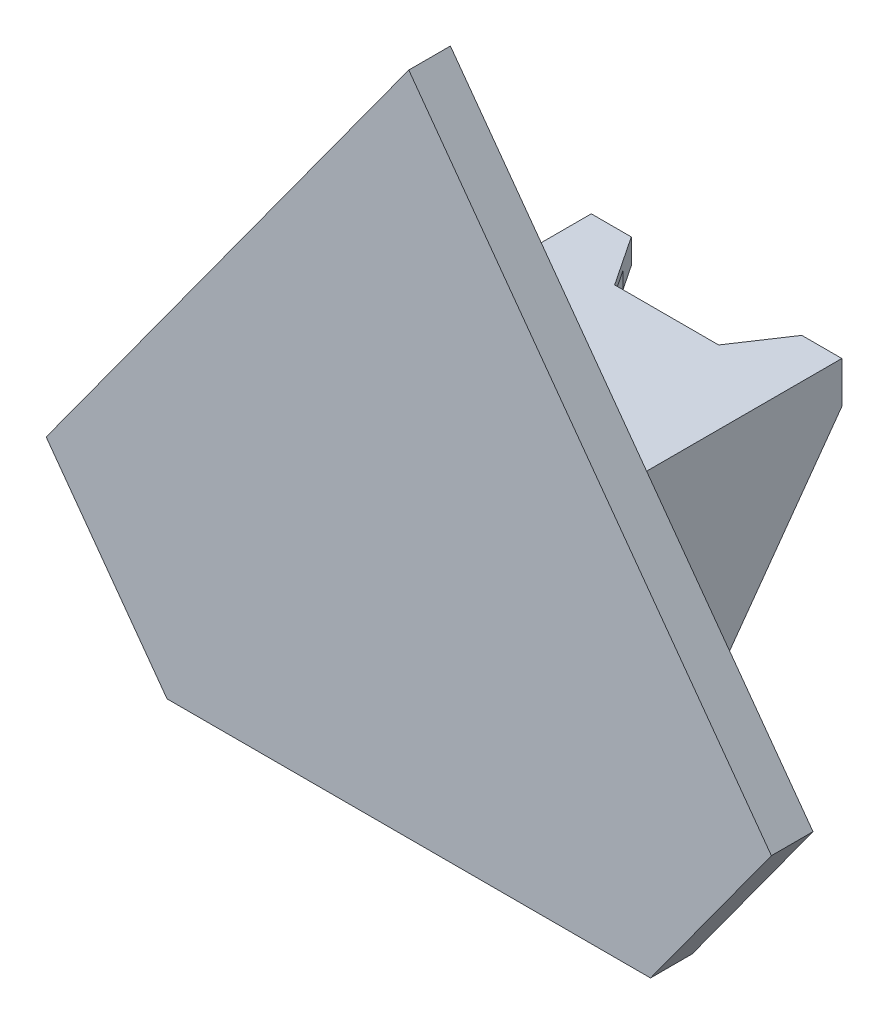
ISO-10303-21;
HEADER;
FILE_DESCRIPTION(('STEP AP214'),'2;1');
FILE_NAME('part.step','',(''),(''),'','','');
FILE_SCHEMA(('AUTOMOTIVE_DESIGN { 1 0 10303 214 1 1 1 1 }'));
ENDSEC;
DATA;
#1=APPLICATION_CONTEXT('core data for automotive mechanical design processes');
#2=APPLICATION_PROTOCOL_DEFINITION('international standard','automotive_design',2000,#1);
#3=PRODUCT_CONTEXT('',#1,'mechanical');
#4=PRODUCT('Part','Part','',(#3));
#5=PRODUCT_RELATED_PRODUCT_CATEGORY('part','',(#4));
#6=PRODUCT_DEFINITION_FORMATION('','',#4);
#7=PRODUCT_DEFINITION_CONTEXT('part definition',#1,'design');
#8=PRODUCT_DEFINITION('design','',#6,#7);
#9=PRODUCT_DEFINITION_SHAPE('','',#8);
#10=(LENGTH_UNIT() NAMED_UNIT(*) SI_UNIT(.MILLI.,.METRE.));
#11=(NAMED_UNIT(*) PLANE_ANGLE_UNIT() SI_UNIT($,.RADIAN.));
#12=(NAMED_UNIT(*) SI_UNIT($,.STERADIAN.) SOLID_ANGLE_UNIT());
#13=UNCERTAINTY_MEASURE_WITH_UNIT(LENGTH_MEASURE(1.E-05),#10,'distance_accuracy_value','');
#14=(GEOMETRIC_REPRESENTATION_CONTEXT(3) GLOBAL_UNCERTAINTY_ASSIGNED_CONTEXT((#13)) GLOBAL_UNIT_ASSIGNED_CONTEXT((#10,
#11,#12)) REPRESENTATION_CONTEXT('',''));
#15=CARTESIAN_POINT('',(0.,0.,0.));
#16=DIRECTION('',(0.,0.,1.));
#17=DIRECTION('',(1.,0.,0.));
#18=AXIS2_PLACEMENT_3D('',#15,#16,#17);
#19=CARTESIAN_POINT('',(0.,32.5,0.));
#20=DIRECTION('',(0.,-1.,0.));
#21=DIRECTION('',(0.,0.,-1.));
#22=AXIS2_PLACEMENT_3D('',#19,#20,#21);
#23=PLANE('',#22);
#24=CARTESIAN_POINT('',(-10.2499,32.5,-8.7));
#25=DIRECTION('',(0.,1.,0.));
#26=DIRECTION('',(0.,0.,1.));
#27=AXIS2_PLACEMENT_3D('',#24,#25,#26);
#28=CIRCLE('',#27,1.05);
#29=CARTESIAN_POINT('',(-10.2499,32.5,-7.65));
#30=VERTEX_POINT('',#29);
#31=EDGE_CURVE('E354',#30,#30,#28,.T.);
#32=ORIENTED_EDGE('',*,*,#31,.T.);
#33=EDGE_LOOP('',(#32));
#34=FACE_BOUND('',#33,.T.);
#35=DIRECTION('',(-0.554690595534133,0.,-0.832056694718568));
#36=VECTOR('',#35,1.);
#37=CARTESIAN_POINT('',(-10.2499,32.5,-32.));
#38=LINE('',#37,#36);
#39=CARTESIAN_POINT('',(-8.24994999999999,32.5,-29.));
#40=VERTEX_POINT('',#39);
#41=CARTESIAN_POINT('',(-10.2499,32.5,-32.));
#42=VERTEX_POINT('',#41);
#43=EDGE_CURVE('E235',#40,#42,#38,.T.);
#44=ORIENTED_EDGE('',*,*,#43,.F.);
#45=DIRECTION('',(0.,0.,1.));
#46=VECTOR('',#45,1.);
#47=CARTESIAN_POINT('',(-8.24994999999999,32.5,-36.));
#48=LINE('',#47,#46);
#49=CARTESIAN_POINT('',(-8.24994999999999,32.5,-2.5));
#50=VERTEX_POINT('',#49);
#51=EDGE_CURVE('E216',#40,#50,#48,.T.);
#52=ORIENTED_EDGE('',*,*,#51,.T.);
#53=DIRECTION('',(-1.,0.,0.));
#54=VECTOR('',#53,1.);
#55=CARTESIAN_POINT('',(-12.561,32.5,-2.5));
#56=LINE('',#55,#54);
#57=CARTESIAN_POINT('',(-12.561,32.5,-2.5));
#58=VERTEX_POINT('',#57);
#59=EDGE_CURVE('E226',#50,#58,#56,.T.);
#60=ORIENTED_EDGE('',*,*,#59,.T.);
#61=DIRECTION('',(0.,0.,-1.));
#62=VECTOR('',#61,1.);
#63=CARTESIAN_POINT('',(-12.561,32.5,-2.5));
#64=LINE('',#63,#62);
#65=CARTESIAN_POINT('',(-12.561,32.5,-32.));
#66=VERTEX_POINT('',#65);
#67=EDGE_CURVE('E241',#58,#66,#64,.T.);
#68=ORIENTED_EDGE('',*,*,#67,.T.);
#69=DIRECTION('',(-1.,0.,0.));
#70=VECTOR('',#69,1.);
#71=CARTESIAN_POINT('',(-15.061,32.5,-32.));
#72=LINE('',#71,#70);
#73=EDGE_CURVE('E369',#42,#66,#72,.T.);
#74=ORIENTED_EDGE('',*,*,#73,.F.);
#75=EDGE_LOOP('',(#44,#52,#60,#68,#74));
#76=FACE_BOUND('',#75,.T.);
#77=ADVANCED_FACE('F39',(#34,#76),#23,.T.);
#78=CARTESIAN_POINT('',(6.25,35.5,-26.));
#79=DIRECTION('',(0.832056694718569,0.,0.554690595534133));
#80=DIRECTION('',(0.554690595534133,0.,-0.832056694718568));
#81=AXIS2_PLACEMENT_3D('',#78,#79,#80);
#82=PLANE('',#81);
#83=DIRECTION('',(0.,-1.,0.));
#84=VECTOR('',#83,1.);
#85=CARTESIAN_POINT('',(8.24994999999999,35.5,-29.));
#86=LINE('',#85,#84);
#87=CARTESIAN_POINT('',(8.24994999999999,34.5,-29.));
#88=VERTEX_POINT('',#87);
#89=CARTESIAN_POINT('',(8.24994999999999,32.5,-29.));
#90=VERTEX_POINT('',#89);
#91=EDGE_CURVE('E11',#88,#90,#86,.T.);
#92=ORIENTED_EDGE('',*,*,#91,.F.);
#93=DIRECTION('',(0.554690595534133,0.,-0.832056694718568));
#94=VECTOR('',#93,1.);
#95=CARTESIAN_POINT('',(6.25,34.5,-26.));
#96=LINE('',#95,#94);
#97=CARTESIAN_POINT('',(6.25,34.5,-26.));
#98=VERTEX_POINT('',#97);
#99=EDGE_CURVE('E291',#98,#88,#96,.T.);
#100=ORIENTED_EDGE('',*,*,#99,.F.);
#101=DIRECTION('',(0.,-1.,0.));
#102=VECTOR('',#101,1.);
#103=CARTESIAN_POINT('',(6.25,35.5,-26.));
#104=LINE('',#103,#102);
#105=CARTESIAN_POINT('',(6.25,35.5,-26.));
#106=VERTEX_POINT('',#105);
#107=EDGE_CURVE('E294',#106,#98,#104,.T.);
#108=ORIENTED_EDGE('',*,*,#107,.F.);
#109=DIRECTION('',(-0.554690595534133,0.,0.832056694718568));
#110=VECTOR('',#109,1.);
#111=CARTESIAN_POINT('',(6.25,35.5,-26.));
#112=LINE('',#111,#110);
#113=CARTESIAN_POINT('',(10.2499,35.5,-32.));
#114=VERTEX_POINT('',#113);
#115=EDGE_CURVE('E374',#114,#106,#112,.T.);
#116=ORIENTED_EDGE('',*,*,#115,.F.);
#117=DIRECTION('',(0.,-1.,0.));
#118=VECTOR('',#117,1.);
#119=CARTESIAN_POINT('',(10.2499,35.5,-32.));
#120=LINE('',#119,#118);
#121=CARTESIAN_POINT('',(10.2499,32.5,-32.));
#122=VERTEX_POINT('',#121);
#123=EDGE_CURVE('E398',#114,#122,#120,.T.);
#124=ORIENTED_EDGE('',*,*,#123,.T.);
#125=DIRECTION('',(-0.554690595534133,0.,0.832056694718568));
#126=VECTOR('',#125,1.);
#127=CARTESIAN_POINT('',(6.25,32.5,-26.));
#128=LINE('',#127,#126);
#129=EDGE_CURVE('E389',#122,#90,#128,.T.);
#130=ORIENTED_EDGE('',*,*,#129,.T.);
#131=EDGE_LOOP('',(#92,#100,#108,#116,#124,#130));
#132=FACE_BOUND('',#131,.T.);
#133=ADVANCED_FACE('F472',(#132),#82,.F.);
#134=CARTESIAN_POINT('',(-6.25,35.5,-26.));
#135=DIRECTION('',(0.,0.,1.));
#136=DIRECTION('',(1.,0.,0.));
#137=AXIS2_PLACEMENT_3D('',#134,#135,#136);
#138=PLANE('',#137);
#139=DIRECTION('',(1.,0.,0.));
#140=VECTOR('',#139,1.);
#141=CARTESIAN_POINT('',(-6.25,34.5,-26.));
#142=LINE('',#141,#140);
#143=CARTESIAN_POINT('',(-6.25,34.5,-26.));
#144=VERTEX_POINT('',#143);
#145=EDGE_CURVE('E289',#144,#98,#142,.T.);
#146=ORIENTED_EDGE('',*,*,#145,.F.);
#147=DIRECTION('',(0.,-1.,0.));
#148=VECTOR('',#147,1.);
#149=CARTESIAN_POINT('',(-6.25,35.5,-26.));
#150=LINE('',#149,#148);
#151=CARTESIAN_POINT('',(-6.25,35.5,-26.));
#152=VERTEX_POINT('',#151);
#153=EDGE_CURVE('E284',#152,#144,#150,.T.);
#154=ORIENTED_EDGE('',*,*,#153,.F.);
#155=DIRECTION('',(-1.,0.,0.));
#156=VECTOR('',#155,1.);
#157=CARTESIAN_POINT('',(-6.25,35.5,-26.));
#158=LINE('',#157,#156);
#159=EDGE_CURVE('E380',#106,#152,#158,.T.);
#160=ORIENTED_EDGE('',*,*,#159,.F.);
#161=ORIENTED_EDGE('',*,*,#107,.T.);
#162=EDGE_LOOP('',(#146,#154,#160,#161));
#163=FACE_BOUND('',#162,.T.);
#164=ADVANCED_FACE('F287',(#163),#138,.F.);
#165=CARTESIAN_POINT('',(-10.2499,35.5,-32.));
#166=DIRECTION('',(-0.832056694718569,0.,0.554690595534133));
#167=DIRECTION('',(0.554690595534133,0.,0.832056694718568));
#168=AXIS2_PLACEMENT_3D('',#165,#166,#167);
#169=PLANE('',#168);
#170=DIRECTION('',(0.,1.,0.));
#171=VECTOR('',#170,1.);
#172=CARTESIAN_POINT('',(-8.24994999999999,35.5,-29.));
#173=LINE('',#172,#171);
#174=CARTESIAN_POINT('',(-8.24994999999999,34.5,-29.));
#175=VERTEX_POINT('',#174);
#176=EDGE_CURVE('E50',#40,#175,#173,.T.);
#177=ORIENTED_EDGE('',*,*,#176,.F.);
#178=ORIENTED_EDGE('',*,*,#43,.T.);
#179=DIRECTION('',(0.,-1.,0.));
#180=VECTOR('',#179,1.);
#181=CARTESIAN_POINT('',(-10.2499,35.5,-32.));
#182=LINE('',#181,#180);
#183=CARTESIAN_POINT('',(-10.2499,35.5,-32.));
#184=VERTEX_POINT('',#183);
#185=EDGE_CURVE('E384',#184,#42,#182,.T.);
#186=ORIENTED_EDGE('',*,*,#185,.F.);
#187=DIRECTION('',(-0.554690595534133,0.,-0.832056694718568));
#188=VECTOR('',#187,1.);
#189=CARTESIAN_POINT('',(-10.2499,35.5,-32.));
#190=LINE('',#189,#188);
#191=EDGE_CURVE('E376',#152,#184,#190,.T.);
#192=ORIENTED_EDGE('',*,*,#191,.F.);
#193=ORIENTED_EDGE('',*,*,#153,.T.);
#194=DIRECTION('',(0.554690595534133,0.,0.832056694718568));
#195=VECTOR('',#194,1.);
#196=CARTESIAN_POINT('',(-10.2499,34.5,-32.));
#197=LINE('',#196,#195);
#198=EDGE_CURVE('E276',#175,#144,#197,.T.);
#199=ORIENTED_EDGE('',*,*,#198,.F.);
#200=EDGE_LOOP('',(#177,#178,#186,#192,#193,#199));
#201=FACE_BOUND('',#200,.T.);
#202=ADVANCED_FACE('F279',(#201),#169,.F.);
#203=CARTESIAN_POINT('',(-43.5925516803215,16.5,5.));
#204=DIRECTION('',(0.809016994374949,-0.587785252292471,0.));
#205=DIRECTION('',(0.587785252292471,0.809016994374949,0.));
#206=AXIS2_PLACEMENT_3D('',#203,#204,#205);
#207=PLANE('',#206);
#208=DIRECTION('',(0.,0.,-1.));
#209=VECTOR('',#208,1.);
#210=CARTESIAN_POINT('',(-43.5925516803215,16.5,5.));
#211=LINE('',#210,#209);
#212=CARTESIAN_POINT('',(-43.5925516803215,16.5,5.));
#213=VERTEX_POINT('',#212);
#214=CARTESIAN_POINT('',(-43.5925516803215,16.5,0.));
#215=VERTEX_POINT('',#214);
#216=EDGE_CURVE('E314',#213,#215,#211,.T.);
#217=ORIENTED_EDGE('',*,*,#216,.F.);
#218=DIRECTION('',(-0.587785252292471,-0.809016994374949,0.));
#219=VECTOR('',#218,1.);
#220=CARTESIAN_POINT('',(-43.5925516803215,16.5,5.));
#221=LINE('',#220,#219);
#222=CARTESIAN_POINT('',(0.,76.5,5.));
#223=VERTEX_POINT('',#222);
#224=EDGE_CURVE('E322',#223,#213,#221,.T.);
#225=ORIENTED_EDGE('',*,*,#224,.F.);
#226=DIRECTION('',(0.,0.,-1.));
#227=VECTOR('',#226,1.);
#228=CARTESIAN_POINT('',(0.,76.5,5.));
#229=LINE('',#228,#227);
#230=CARTESIAN_POINT('',(0.,76.5,0.));
#231=VERTEX_POINT('',#230);
#232=EDGE_CURVE('E328',#223,#231,#229,.T.);
#233=ORIENTED_EDGE('',*,*,#232,.T.);
#234=DIRECTION('',(-0.587785252292471,-0.809016994374949,0.));
#235=VECTOR('',#234,1.);
#236=CARTESIAN_POINT('',(-43.5925516803215,16.5,0.));
#237=LINE('',#236,#235);
#238=EDGE_CURVE('E323',#231,#215,#237,.T.);
#239=ORIENTED_EDGE('',*,*,#238,.T.);
#240=EDGE_LOOP('',(#217,#225,#233,#239));
#241=FACE_BOUND('',#240,.T.);
#242=ADVANCED_FACE('F714',(#241),#207,.F.);
#243=CARTESIAN_POINT('',(-58.1234022404286,-3.50000000000001,122.954735182657));
#244=DIRECTION('',(0.,1.,0.));
#245=DIRECTION('',(0.,0.,1.));
#246=AXIS2_PLACEMENT_3D('',#243,#244,#245);
#247=PLANE('',#246);
#248=DIRECTION('',(0.,0.,-1.));
#249=VECTOR('',#248,1.);
#250=CARTESIAN_POINT('',(29.0617011202143,-3.50000000000001,5.));
#251=LINE('',#250,#249);
#252=CARTESIAN_POINT('',(29.0617011202143,-3.50000000000001,5.));
#253=VERTEX_POINT('',#252);
#254=CARTESIAN_POINT('',(29.0617011202143,-3.50000000000001,0.));
#255=VERTEX_POINT('',#254);
#256=EDGE_CURVE('E304',#253,#255,#251,.T.);
#257=ORIENTED_EDGE('',*,*,#256,.F.);
#258=DIRECTION('',(-1.,0.,0.));
#259=VECTOR('',#258,1.);
#260=CARTESIAN_POINT('',(-58.1234022404286,-3.50000000000001,5.));
#261=LINE('',#260,#259);
#262=CARTESIAN_POINT('',(-29.0617011202143,-3.5,5.));
#263=VERTEX_POINT('',#262);
#264=EDGE_CURVE('E319',#253,#263,#261,.T.);
#265=ORIENTED_EDGE('',*,*,#264,.T.);
#266=DIRECTION('',(0.,0.,-1.));
#267=VECTOR('',#266,1.);
#268=CARTESIAN_POINT('',(-29.0617011202143,-3.5,5.));
#269=LINE('',#268,#267);
#270=CARTESIAN_POINT('',(-29.0617011202143,-3.50000000000001,0.));
#271=VERTEX_POINT('',#270);
#272=EDGE_CURVE('E298',#263,#271,#269,.T.);
#273=ORIENTED_EDGE('',*,*,#272,.T.);
#274=DIRECTION('',(1.,0.,0.));
#275=VECTOR('',#274,1.);
#276=CARTESIAN_POINT('',(-58.1234022404286,-3.50000000000001,0.));
#277=LINE('',#276,#275);
#278=EDGE_CURVE('E309',#271,#255,#277,.T.);
#279=ORIENTED_EDGE('',*,*,#278,.T.);
#280=EDGE_LOOP('',(#257,#265,#273,#279));
#281=FACE_BOUND('',#280,.T.);
#282=ADVANCED_FACE('F710',(#281),#247,.F.);
#283=CARTESIAN_POINT('',(-15.061,32.5,-32.));
#284=DIRECTION('',(1.,0.,0.));
#285=DIRECTION('',(0.,0.,-1.));
#286=AXIS2_PLACEMENT_3D('',#283,#284,#285);
#287=PLANE('',#286);
#288=DIRECTION('',(0.,0.811029676142761,-0.585005012299697));
#289=VECTOR('',#288,1.);
#290=CARTESIAN_POINT('',(-15.061,0.,-10.));
#291=LINE('',#290,#289);
#292=CARTESIAN_POINT('',(-15.061,0.,-10.));
#293=VERTEX_POINT('',#292);
#294=CARTESIAN_POINT('',(-15.061,30.5,-32.));
#295=VERTEX_POINT('',#294);
#296=EDGE_CURVE('E338',#293,#295,#291,.T.);
#297=ORIENTED_EDGE('',*,*,#296,.F.);
#298=DIRECTION('',(0.,1.,0.));
#299=VECTOR('',#298,1.);
#300=CARTESIAN_POINT('',(-15.061,-2.5,-10.));
#301=LINE('',#300,#299);
#302=CARTESIAN_POINT('',(-15.061,-2.5,-10.));
#303=VERTEX_POINT('',#302);
#304=EDGE_CURVE('E255',#303,#293,#301,.T.);
#305=ORIENTED_EDGE('',*,*,#304,.F.);
#306=DIRECTION('',(0.,0.,-1.));
#307=VECTOR('',#306,1.);
#308=CARTESIAN_POINT('',(-15.061,-2.5,-10.));
#309=LINE('',#308,#307);
#310=CARTESIAN_POINT('',(-15.061,-2.5,0.));
#311=VERTEX_POINT('',#310);
#312=EDGE_CURVE('E415',#311,#303,#309,.T.);
#313=ORIENTED_EDGE('',*,*,#312,.F.);
#314=DIRECTION('',(0.,-1.,0.));
#315=VECTOR('',#314,1.);
#316=CARTESIAN_POINT('',(-15.061,32.5,0.));
#317=LINE('',#316,#315);
#318=CARTESIAN_POINT('',(-15.061,35.5,0.));
#319=VERTEX_POINT('',#318);
#320=EDGE_CURVE('E268',#319,#311,#317,.T.);
#321=ORIENTED_EDGE('',*,*,#320,.F.);
#322=DIRECTION('',(0.,0.,1.));
#323=VECTOR('',#322,1.);
#324=CARTESIAN_POINT('',(-15.061,35.5,0.));
#325=LINE('',#324,#323);
#326=CARTESIAN_POINT('',(-15.061,35.5,-32.));
#327=VERTEX_POINT('',#326);
#328=EDGE_CURVE('E363',#327,#319,#325,.T.);
#329=ORIENTED_EDGE('',*,*,#328,.F.);
#330=DIRECTION('',(0.,-1.,0.));
#331=VECTOR('',#330,1.);
#332=CARTESIAN_POINT('',(-15.061,32.5,-32.));
#333=LINE('',#332,#331);
#334=EDGE_CURVE('E269',#327,#295,#333,.T.);
#335=ORIENTED_EDGE('',*,*,#334,.T.);
#336=EDGE_LOOP('',(#297,#305,#313,#321,#329,#335));
#337=FACE_BOUND('',#336,.T.);
#338=ADVANCED_FACE('F521',(#337),#287,.F.);
#339=CARTESIAN_POINT('',(-12.561,32.5,-2.5));
#340=DIRECTION('',(-1.,0.,0.));
#341=DIRECTION('',(0.,0.,1.));
#342=AXIS2_PLACEMENT_3D('',#339,#340,#341);
#343=PLANE('',#342);
#344=DIRECTION('',(0.,0.,-1.));
#345=VECTOR('',#344,1.);
#346=CARTESIAN_POINT('',(-12.561,0.,-2.5));
#347=LINE('',#346,#345);
#348=CARTESIAN_POINT('',(-12.561,0.,-2.5));
#349=VERTEX_POINT('',#348);
#350=CARTESIAN_POINT('',(-12.561,0.,-10.));
#351=VERTEX_POINT('',#350);
#352=EDGE_CURVE('E246',#349,#351,#347,.T.);
#353=ORIENTED_EDGE('',*,*,#352,.T.);
#354=DIRECTION('',(0.,0.811029676142761,-0.585005012299697));
#355=VECTOR('',#354,1.);
#356=CARTESIAN_POINT('',(-12.561,17.8190737139827,-22.8531023510695));
#357=LINE('',#356,#355);
#358=CARTESIAN_POINT('',(-12.561,30.5,-32.));
#359=VERTEX_POINT('',#358);
#360=EDGE_CURVE('E348',#351,#359,#357,.T.);
#361=ORIENTED_EDGE('',*,*,#360,.T.);
#362=DIRECTION('',(0.,-1.,0.));
#363=VECTOR('',#362,1.);
#364=CARTESIAN_POINT('',(-12.561,32.5,-32.));
#365=LINE('',#364,#363);
#366=EDGE_CURVE('E273',#66,#359,#365,.T.);
#367=ORIENTED_EDGE('',*,*,#366,.F.);
#368=ORIENTED_EDGE('',*,*,#67,.F.);
#369=DIRECTION('',(0.,-1.,0.));
#370=VECTOR('',#369,1.);
#371=CARTESIAN_POINT('',(-12.561,32.5,-2.5));
#372=LINE('',#371,#370);
#373=EDGE_CURVE('E240',#58,#349,#372,.T.);
#374=ORIENTED_EDGE('',*,*,#373,.T.);
#375=EDGE_LOOP('',(#353,#361,#367,#368,#374));
#376=FACE_BOUND('',#375,.T.);
#377=ADVANCED_FACE('F41',(#376),#343,.F.);
#378=CARTESIAN_POINT('',(-15.061,32.5,-32.));
#379=DIRECTION('',(0.,0.,1.));
#380=DIRECTION('',(1.,0.,0.));
#381=AXIS2_PLACEMENT_3D('',#378,#379,#380);
#382=PLANE('',#381);
#383=ORIENTED_EDGE('',*,*,#366,.T.);
#384=DIRECTION('',(-1.,0.,0.));
#385=VECTOR('',#384,1.);
#386=CARTESIAN_POINT('',(15.061,30.5,-32.));
#387=LINE('',#386,#385);
#388=EDGE_CURVE('E337',#359,#295,#387,.T.);
#389=ORIENTED_EDGE('',*,*,#388,.T.);
#390=ORIENTED_EDGE('',*,*,#334,.F.);
#391=DIRECTION('',(-1.,0.,0.));
#392=VECTOR('',#391,1.);
#393=CARTESIAN_POINT('',(-15.061,35.5,-32.));
#394=LINE('',#393,#392);
#395=EDGE_CURVE('E382',#184,#327,#394,.T.);
#396=ORIENTED_EDGE('',*,*,#395,.F.);
#397=ORIENTED_EDGE('',*,*,#185,.T.);
#398=ORIENTED_EDGE('',*,*,#73,.T.);
#399=EDGE_LOOP('',(#383,#389,#390,#396,#397,#398));
#400=FACE_BOUND('',#399,.T.);
#401=ADVANCED_FACE('F464',(#400),#382,.F.);
#402=CARTESIAN_POINT('',(15.061,32.5,0.));
#403=DIRECTION('',(-1.,0.,0.));
#404=DIRECTION('',(0.,0.,1.));
#405=AXIS2_PLACEMENT_3D('',#402,#403,#404);
#406=PLANE('',#405);
#407=DIRECTION('',(0.,1.,0.));
#408=VECTOR('',#407,1.);
#409=CARTESIAN_POINT('',(15.061,-2.5,-10.));
#410=LINE('',#409,#408);
#411=CARTESIAN_POINT('',(15.061,-2.5,-10.));
#412=VERTEX_POINT('',#411);
#413=CARTESIAN_POINT('',(15.061,0.,-10.));
#414=VERTEX_POINT('',#413);
#415=EDGE_CURVE('E435',#412,#414,#410,.T.);
#416=ORIENTED_EDGE('',*,*,#415,.T.);
#417=DIRECTION('',(0.,0.811029676142761,-0.585005012299697));
#418=VECTOR('',#417,1.);
#419=CARTESIAN_POINT('',(15.061,0.,-10.));
#420=LINE('',#419,#418);
#421=CARTESIAN_POINT('',(15.061,30.5,-32.));
#422=VERTEX_POINT('',#421);
#423=EDGE_CURVE('E340',#414,#422,#420,.T.);
#424=ORIENTED_EDGE('',*,*,#423,.T.);
#425=DIRECTION('',(0.,-1.,0.));
#426=VECTOR('',#425,1.);
#427=CARTESIAN_POINT('',(15.061,32.5,-32.));
#428=LINE('',#427,#426);
#429=CARTESIAN_POINT('',(15.061,35.5,-32.));
#430=VERTEX_POINT('',#429);
#431=EDGE_CURVE('E261',#430,#422,#428,.T.);
#432=ORIENTED_EDGE('',*,*,#431,.F.);
#433=DIRECTION('',(0.,0.,-1.));
#434=VECTOR('',#433,1.);
#435=CARTESIAN_POINT('',(15.061,35.5,0.));
#436=LINE('',#435,#434);
#437=CARTESIAN_POINT('',(15.061,35.5,0.));
#438=VERTEX_POINT('',#437);
#439=EDGE_CURVE('E368',#438,#430,#436,.T.);
#440=ORIENTED_EDGE('',*,*,#439,.F.);
#441=DIRECTION('',(0.,-1.,0.));
#442=VECTOR('',#441,1.);
#443=CARTESIAN_POINT('',(15.061,32.5,0.));
#444=LINE('',#443,#442);
#445=CARTESIAN_POINT('',(15.061,-2.5,0.));
#446=VERTEX_POINT('',#445);
#447=EDGE_CURVE('E266',#438,#446,#444,.T.);
#448=ORIENTED_EDGE('',*,*,#447,.T.);
#449=DIRECTION('',(0.,0.,1.));
#450=VECTOR('',#449,1.);
#451=CARTESIAN_POINT('',(15.061,-2.5,-10.));
#452=LINE('',#451,#450);
#453=EDGE_CURVE('E426',#412,#446,#452,.T.);
#454=ORIENTED_EDGE('',*,*,#453,.F.);
#455=EDGE_LOOP('',(#416,#424,#432,#440,#448,#454));
#456=FACE_BOUND('',#455,.T.);
#457=ADVANCED_FACE('F594',(#456),#406,.F.);
#458=CARTESIAN_POINT('',(15.061,32.5,-32.));
#459=DIRECTION('',(0.,0.,1.));
#460=DIRECTION('',(1.,0.,0.));
#461=AXIS2_PLACEMENT_3D('',#458,#459,#460);
#462=PLANE('',#461);
#463=ORIENTED_EDGE('',*,*,#431,.T.);
#464=CARTESIAN_POINT('',(12.561,30.5,-32.));
#465=VERTEX_POINT('',#464);
#466=EDGE_CURVE('E345',#422,#465,#387,.T.);
#467=ORIENTED_EDGE('',*,*,#466,.T.);
#468=DIRECTION('',(0.,-1.,0.));
#469=VECTOR('',#468,1.);
#470=CARTESIAN_POINT('',(12.561,32.5,-32.));
#471=LINE('',#470,#469);
#472=CARTESIAN_POINT('',(12.561,32.5,-32.));
#473=VERTEX_POINT('',#472);
#474=EDGE_CURVE('E259',#473,#465,#471,.T.);
#475=ORIENTED_EDGE('',*,*,#474,.F.);
#476=DIRECTION('',(-1.,0.,0.));
#477=VECTOR('',#476,1.);
#478=CARTESIAN_POINT('',(10.2499,32.5,-32.));
#479=LINE('',#478,#477);
#480=EDGE_CURVE('E364',#473,#122,#479,.T.);
#481=ORIENTED_EDGE('',*,*,#480,.T.);
#482=ORIENTED_EDGE('',*,*,#123,.F.);
#483=DIRECTION('',(-1.,0.,0.));
#484=VECTOR('',#483,1.);
#485=CARTESIAN_POINT('',(10.2499,35.5,-32.));
#486=LINE('',#485,#484);
#487=EDGE_CURVE('E371',#430,#114,#486,.T.);
#488=ORIENTED_EDGE('',*,*,#487,.F.);
#489=EDGE_LOOP('',(#463,#467,#475,#481,#482,#488));
#490=FACE_BOUND('',#489,.T.);
#491=ADVANCED_FACE('F596',(#490),#462,.F.);
#492=CARTESIAN_POINT('',(12.561,32.5,-2.49999999999999));
#493=DIRECTION('',(1.,0.,0.));
#494=DIRECTION('',(0.,0.,-1.));
#495=AXIS2_PLACEMENT_3D('',#492,#493,#494);
#496=PLANE('',#495);
#497=ORIENTED_EDGE('',*,*,#474,.T.);
#498=DIRECTION('',(0.,-0.811029676142761,0.585005012299697));
#499=VECTOR('',#498,1.);
#500=CARTESIAN_POINT('',(12.561,17.8190737139827,-22.8531023510695));
#501=LINE('',#500,#499);
#502=CARTESIAN_POINT('',(12.561,0.,-10.));
#503=VERTEX_POINT('',#502);
#504=EDGE_CURVE('E344',#465,#503,#501,.T.);
#505=ORIENTED_EDGE('',*,*,#504,.T.);
#506=DIRECTION('',(0.,0.,1.));
#507=VECTOR('',#506,1.);
#508=CARTESIAN_POINT('',(12.561,0.,-2.49999999999999));
#509=LINE('',#508,#507);
#510=CARTESIAN_POINT('',(12.561,0.,-2.49999999999999));
#511=VERTEX_POINT('',#510);
#512=EDGE_CURVE('E252',#503,#511,#509,.T.);
#513=ORIENTED_EDGE('',*,*,#512,.T.);
#514=DIRECTION('',(0.,-1.,0.));
#515=VECTOR('',#514,1.);
#516=CARTESIAN_POINT('',(12.561,32.5,-2.49999999999999));
#517=LINE('',#516,#515);
#518=CARTESIAN_POINT('',(12.561,32.5,-2.49999999999999));
#519=VERTEX_POINT('',#518);
#520=EDGE_CURVE('E257',#519,#511,#517,.T.);
#521=ORIENTED_EDGE('',*,*,#520,.F.);
#522=DIRECTION('',(0.,0.,1.));
#523=VECTOR('',#522,1.);
#524=CARTESIAN_POINT('',(12.561,32.5,-2.49999999999999));
#525=LINE('',#524,#523);
#526=EDGE_CURVE('E237',#473,#519,#525,.T.);
#527=ORIENTED_EDGE('',*,*,#526,.F.);
#528=EDGE_LOOP('',(#497,#505,#513,#521,#527));
#529=FACE_BOUND('',#528,.T.);
#530=ADVANCED_FACE('F494',(#529),#496,.F.);
#531=CARTESIAN_POINT('',(-12.561,32.5,-2.5));
#532=DIRECTION('',(0.,0.,1.));
#533=DIRECTION('',(1.,0.,0.));
#534=AXIS2_PLACEMENT_3D('',#531,#532,#533);
#535=PLANE('',#534);
#536=DIRECTION('',(-1.,0.,0.));
#537=VECTOR('',#536,1.);
#538=CARTESIAN_POINT('',(-12.561,0.,-2.5));
#539=LINE('',#538,#537);
#540=EDGE_CURVE('E251',#511,#349,#539,.T.);
#541=ORIENTED_EDGE('',*,*,#540,.T.);
#542=ORIENTED_EDGE('',*,*,#373,.F.);
#543=ORIENTED_EDGE('',*,*,#59,.F.);
#544=DIRECTION('',(0.,1.,0.));
#545=VECTOR('',#544,1.);
#546=CARTESIAN_POINT('',(-8.24994999999999,34.5,-2.5));
#547=LINE('',#546,#545);
#548=CARTESIAN_POINT('',(-8.24994999999999,34.5,-2.5));
#549=VERTEX_POINT('',#548);
#550=EDGE_CURVE('E217',#50,#549,#547,.T.);
#551=ORIENTED_EDGE('',*,*,#550,.T.);
#552=DIRECTION('',(1.,0.,0.));
#553=VECTOR('',#552,1.);
#554=CARTESIAN_POINT('',(8.24995,34.5,-2.5));
#555=LINE('',#554,#553);
#556=CARTESIAN_POINT('',(8.24994999999999,34.5,-2.5));
#557=VERTEX_POINT('',#556);
#558=EDGE_CURVE('E222',#549,#557,#555,.T.);
#559=ORIENTED_EDGE('',*,*,#558,.T.);
#560=DIRECTION('',(0.,-1.,0.));
#561=VECTOR('',#560,1.);
#562=CARTESIAN_POINT('',(8.24994999999999,34.5,-2.5));
#563=LINE('',#562,#561);
#564=CARTESIAN_POINT('',(8.24994999999999,32.5,-2.5));
#565=VERTEX_POINT('',#564);
#566=EDGE_CURVE('E482',#557,#565,#563,.T.);
#567=ORIENTED_EDGE('',*,*,#566,.T.);
#568=EDGE_CURVE('E238',#519,#565,#56,.T.);
#569=ORIENTED_EDGE('',*,*,#568,.F.);
#570=ORIENTED_EDGE('',*,*,#520,.T.);
#571=EDGE_LOOP('',(#541,#542,#543,#551,#559,#567,#569,#570));
#572=FACE_BOUND('',#571,.T.);
#573=ADVANCED_FACE('F239',(#572),#535,.F.);
#574=CARTESIAN_POINT('',(0.,-2.5,0.));
#575=DIRECTION('',(0.,-1.,0.));
#576=DIRECTION('',(0.,0.,-1.));
#577=AXIS2_PLACEMENT_3D('',#574,#575,#576);
#578=PLANE('',#577);
#579=CARTESIAN_POINT('',(-10.2499,-2.5,-4.95));
#580=DIRECTION('',(0.,-1.,0.));
#581=DIRECTION('',(0.,0.,-1.));
#582=AXIS2_PLACEMENT_3D('',#579,#580,#581);
#583=CIRCLE('',#582,1.05);
#584=CARTESIAN_POINT('',(-10.2499,-2.5,-6.));
#585=VERTEX_POINT('',#584);
#586=EDGE_CURVE('E408',#585,#585,#583,.T.);
#587=ORIENTED_EDGE('',*,*,#586,.F.);
#588=EDGE_LOOP('',(#587));
#589=FACE_BOUND('',#588,.T.);
#590=ORIENTED_EDGE('',*,*,#312,.T.);
#591=DIRECTION('',(1.,0.,0.));
#592=VECTOR('',#591,1.);
#593=CARTESIAN_POINT('',(-12.561,-2.5,-10.));
#594=LINE('',#593,#592);
#595=CARTESIAN_POINT('',(-12.561,-2.5,-10.));
#596=VERTEX_POINT('',#595);
#597=EDGE_CURVE('E412',#303,#596,#594,.T.);
#598=ORIENTED_EDGE('',*,*,#597,.T.);
#599=DIRECTION('',(0.784545366383926,0.,0.620071421761648));
#600=VECTOR('',#599,1.);
#601=CARTESIAN_POINT('',(-12.561,-2.5,-10.));
#602=LINE('',#601,#600);
#603=CARTESIAN_POINT('',(-7.5,-2.5,-6.));
#604=VERTEX_POINT('',#603);
#605=EDGE_CURVE('E418',#596,#604,#602,.T.);
#606=ORIENTED_EDGE('',*,*,#605,.T.);
#607=DIRECTION('',(1.,0.,0.));
#608=VECTOR('',#607,1.);
#609=CARTESIAN_POINT('',(-7.5,-2.5,-6.));
#610=LINE('',#609,#608);
#611=CARTESIAN_POINT('',(7.5,-2.5,-6.));
#612=VERTEX_POINT('',#611);
#613=EDGE_CURVE('E419',#604,#612,#610,.T.);
#614=ORIENTED_EDGE('',*,*,#613,.T.);
#615=DIRECTION('',(0.784545366383925,0.,-0.620071421761649));
#616=VECTOR('',#615,1.);
#617=CARTESIAN_POINT('',(12.561,-2.5,-10.));
#618=LINE('',#617,#616);
#619=CARTESIAN_POINT('',(12.561,-2.5,-10.));
#620=VERTEX_POINT('',#619);
#621=EDGE_CURVE('E425',#612,#620,#618,.T.);
#622=ORIENTED_EDGE('',*,*,#621,.T.);
#623=DIRECTION('',(1.,0.,0.));
#624=VECTOR('',#623,1.);
#625=CARTESIAN_POINT('',(12.561,-2.5,-10.));
#626=LINE('',#625,#624);
#627=EDGE_CURVE('E422',#620,#412,#626,.T.);
#628=ORIENTED_EDGE('',*,*,#627,.T.);
#629=ORIENTED_EDGE('',*,*,#453,.T.);
#630=DIRECTION('',(-1.,0.,0.));
#631=VECTOR('',#630,1.);
#632=CARTESIAN_POINT('',(15.061,-2.5,0.));
#633=LINE('',#632,#631);
#634=EDGE_CURVE('E428',#446,#311,#633,.T.);
#635=ORIENTED_EDGE('',*,*,#634,.T.);
#636=EDGE_LOOP('',(#590,#598,#606,#614,#622,#628,#629,#635));
#637=FACE_BOUND('',#636,.T.);
#638=CARTESIAN_POINT('',(10.2499,-2.5,-4.95));
#639=DIRECTION('',(0.,-1.,0.));
#640=DIRECTION('',(0.,0.,-1.));
#641=AXIS2_PLACEMENT_3D('',#638,#639,#640);
#642=CIRCLE('',#641,1.05);
#643=CARTESIAN_POINT('',(10.2499,-2.5,-6.));
#644=VERTEX_POINT('',#643);
#645=EDGE_CURVE('E399',#644,#644,#642,.T.);
#646=ORIENTED_EDGE('',*,*,#645,.F.);
#647=EDGE_LOOP('',(#646));
#648=FACE_BOUND('',#647,.T.);
#649=ADVANCED_FACE('F520',(#589,#637,#648),#578,.T.);
#650=CARTESIAN_POINT('',(0.,0.,0.));
#651=DIRECTION('',(0.,-1.,0.));
#652=DIRECTION('',(0.,0.,-1.));
#653=AXIS2_PLACEMENT_3D('',#650,#651,#652);
#654=PLANE('',#653);
#655=ORIENTED_EDGE('',*,*,#352,.F.);
#656=ORIENTED_EDGE('',*,*,#540,.F.);
#657=ORIENTED_EDGE('',*,*,#512,.F.);
#658=DIRECTION('',(0.784545366383925,0.,-0.620071421761649));
#659=VECTOR('',#658,1.);
#660=CARTESIAN_POINT('',(12.561,0.,-10.));
#661=LINE('',#660,#659);
#662=CARTESIAN_POINT('',(7.5,0.,-6.));
#663=VERTEX_POINT('',#662);
#664=EDGE_CURVE('E438',#663,#503,#661,.T.);
#665=ORIENTED_EDGE('',*,*,#664,.F.);
#666=DIRECTION('',(1.,0.,0.));
#667=VECTOR('',#666,1.);
#668=CARTESIAN_POINT('',(-7.5,0.,-6.));
#669=LINE('',#668,#667);
#670=CARTESIAN_POINT('',(-7.5,0.,-6.));
#671=VERTEX_POINT('',#670);
#672=EDGE_CURVE('E436',#671,#663,#669,.T.);
#673=ORIENTED_EDGE('',*,*,#672,.F.);
#674=DIRECTION('',(0.784545366383926,0.,0.620071421761648));
#675=VECTOR('',#674,1.);
#676=CARTESIAN_POINT('',(-12.561,0.,-10.));
#677=LINE('',#676,#675);
#678=EDGE_CURVE('E433',#351,#671,#677,.T.);
#679=ORIENTED_EDGE('',*,*,#678,.F.);
#680=EDGE_LOOP('',(#655,#656,#657,#665,#673,#679));
#681=FACE_BOUND('',#680,.T.);
#682=CARTESIAN_POINT('',(-10.2499,0.,-4.95));
#683=DIRECTION('',(0.,-1.,0.));
#684=DIRECTION('',(0.,0.,-1.));
#685=AXIS2_PLACEMENT_3D('',#682,#683,#684);
#686=CIRCLE('',#685,1.05);
#687=CARTESIAN_POINT('',(-10.2499,0.,-6.));
#688=VERTEX_POINT('',#687);
#689=EDGE_CURVE('E404',#688,#688,#686,.T.);
#690=ORIENTED_EDGE('',*,*,#689,.T.);
#691=EDGE_LOOP('',(#690));
#692=FACE_BOUND('',#691,.T.);
#693=CARTESIAN_POINT('',(10.2499,0.,-4.95));
#694=DIRECTION('',(0.,-1.,0.));
#695=DIRECTION('',(0.,0.,-1.));
#696=AXIS2_PLACEMENT_3D('',#693,#694,#695);
#697=CIRCLE('',#696,1.05);
#698=CARTESIAN_POINT('',(10.2499,0.,-6.));
#699=VERTEX_POINT('',#698);
#700=EDGE_CURVE('E397',#699,#699,#697,.T.);
#701=ORIENTED_EDGE('',*,*,#700,.T.);
#702=EDGE_LOOP('',(#701));
#703=FACE_BOUND('',#702,.T.);
#704=ADVANCED_FACE('F499',(#681,#692,#703),#654,.F.);
#705=CARTESIAN_POINT('',(-12.561,-2.5,-10.));
#706=DIRECTION('',(0.,0.,1.));
#707=DIRECTION('',(1.,0.,0.));
#708=AXIS2_PLACEMENT_3D('',#705,#706,#707);
#709=PLANE('',#708);
#710=DIRECTION('',(1.,0.,0.));
#711=VECTOR('',#710,1.);
#712=CARTESIAN_POINT('',(-12.561,0.,-10.));
#713=LINE('',#712,#711);
#714=EDGE_CURVE('E410',#293,#351,#713,.T.);
#715=ORIENTED_EDGE('',*,*,#714,.T.);
#716=DIRECTION('',(0.,1.,0.));
#717=VECTOR('',#716,1.);
#718=CARTESIAN_POINT('',(-12.561,-2.5,-10.));
#719=LINE('',#718,#717);
#720=EDGE_CURVE('E453',#596,#351,#719,.T.);
#721=ORIENTED_EDGE('',*,*,#720,.F.);
#722=ORIENTED_EDGE('',*,*,#597,.F.);
#723=ORIENTED_EDGE('',*,*,#304,.T.);
#724=EDGE_LOOP('',(#715,#721,#722,#723));
#725=FACE_BOUND('',#724,.T.);
#726=ADVANCED_FACE('F510',(#725),#709,.F.);
#727=CARTESIAN_POINT('',(-12.561,-2.5,-10.));
#728=DIRECTION('',(-0.620071421761648,0.,0.784545366383926));
#729=DIRECTION('',(0.784545366383926,0.,0.620071421761648));
#730=AXIS2_PLACEMENT_3D('',#727,#728,#729);
#731=PLANE('',#730);
#732=ORIENTED_EDGE('',*,*,#678,.T.);
#733=DIRECTION('',(0.,1.,0.));
#734=VECTOR('',#733,1.);
#735=CARTESIAN_POINT('',(-7.5,-2.5,-6.));
#736=LINE('',#735,#734);
#737=EDGE_CURVE('E455',#604,#671,#736,.T.);
#738=ORIENTED_EDGE('',*,*,#737,.F.);
#739=ORIENTED_EDGE('',*,*,#605,.F.);
#740=ORIENTED_EDGE('',*,*,#720,.T.);
#741=EDGE_LOOP('',(#732,#738,#739,#740));
#742=FACE_BOUND('',#741,.T.);
#743=ADVANCED_FACE('F515',(#742),#731,.F.);
#744=CARTESIAN_POINT('',(-7.5,-2.5,-6.));
#745=DIRECTION('',(0.,0.,1.));
#746=DIRECTION('',(1.,0.,0.));
#747=AXIS2_PLACEMENT_3D('',#744,#745,#746);
#748=PLANE('',#747);
#749=ORIENTED_EDGE('',*,*,#672,.T.);
#750=DIRECTION('',(0.,1.,0.));
#751=VECTOR('',#750,1.);
#752=CARTESIAN_POINT('',(7.5,-2.5,-6.));
#753=LINE('',#752,#751);
#754=EDGE_CURVE('E447',#612,#663,#753,.T.);
#755=ORIENTED_EDGE('',*,*,#754,.F.);
#756=ORIENTED_EDGE('',*,*,#613,.F.);
#757=ORIENTED_EDGE('',*,*,#737,.T.);
#758=EDGE_LOOP('',(#749,#755,#756,#757));
#759=FACE_BOUND('',#758,.T.);
#760=ADVANCED_FACE('F635',(#759),#748,.F.);
#761=CARTESIAN_POINT('',(12.561,-2.5,-10.));
#762=DIRECTION('',(0.620071421761649,0.,0.784545366383925));
#763=DIRECTION('',(0.784545366383925,0.,-0.620071421761649));
#764=AXIS2_PLACEMENT_3D('',#761,#762,#763);
#765=PLANE('',#764);
#766=ORIENTED_EDGE('',*,*,#664,.T.);
#767=DIRECTION('',(0.,1.,0.));
#768=VECTOR('',#767,1.);
#769=CARTESIAN_POINT('',(12.561,-2.5,-10.));
#770=LINE('',#769,#768);
#771=EDGE_CURVE('E448',#620,#503,#770,.T.);
#772=ORIENTED_EDGE('',*,*,#771,.F.);
#773=ORIENTED_EDGE('',*,*,#621,.F.);
#774=ORIENTED_EDGE('',*,*,#754,.T.);
#775=EDGE_LOOP('',(#766,#772,#773,#774));
#776=FACE_BOUND('',#775,.T.);
#777=ADVANCED_FACE('F637',(#776),#765,.F.);
#778=CARTESIAN_POINT('',(12.561,-2.5,-10.));
#779=DIRECTION('',(0.,0.,1.));
#780=DIRECTION('',(1.,0.,0.));
#781=AXIS2_PLACEMENT_3D('',#778,#779,#780);
#782=PLANE('',#781);
#783=DIRECTION('',(1.,0.,0.));
#784=VECTOR('',#783,1.);
#785=CARTESIAN_POINT('',(12.561,0.,-10.));
#786=LINE('',#785,#784);
#787=EDGE_CURVE('E416',#503,#414,#786,.T.);
#788=ORIENTED_EDGE('',*,*,#787,.T.);
#789=ORIENTED_EDGE('',*,*,#415,.F.);
#790=ORIENTED_EDGE('',*,*,#627,.F.);
#791=ORIENTED_EDGE('',*,*,#771,.T.);
#792=EDGE_LOOP('',(#788,#789,#790,#791));
#793=FACE_BOUND('',#792,.T.);
#794=ADVANCED_FACE('F642',(#793),#782,.F.);
#795=CARTESIAN_POINT('',(-10.2499,-2.5,-4.95));
#796=DIRECTION('',(0.,1.,0.));
#797=DIRECTION('',(0.,0.,1.));
#798=AXIS2_PLACEMENT_3D('',#795,#796,#797);
#799=CYLINDRICAL_SURFACE('',#798,1.05);
#800=ORIENTED_EDGE('',*,*,#586,.T.);
#801=EDGE_LOOP('',(#800));
#802=FACE_BOUND('',#801,.T.);
#803=ORIENTED_EDGE('',*,*,#689,.F.);
#804=EDGE_LOOP('',(#803));
#805=FACE_BOUND('',#804,.T.);
#806=ADVANCED_FACE('F562',(#802,#805),#799,.F.);
#807=CARTESIAN_POINT('',(10.2499,-2.5,-4.95));
#808=DIRECTION('',(0.,1.,0.));
#809=DIRECTION('',(0.,0.,1.));
#810=AXIS2_PLACEMENT_3D('',#807,#808,#809);
#811=CYLINDRICAL_SURFACE('',#810,1.05);
#812=ORIENTED_EDGE('',*,*,#645,.T.);
#813=EDGE_LOOP('',(#812));
#814=FACE_BOUND('',#813,.T.);
#815=ORIENTED_EDGE('',*,*,#700,.F.);
#816=EDGE_LOOP('',(#815));
#817=FACE_BOUND('',#816,.T.);
#818=ADVANCED_FACE('F559',(#814,#817),#811,.F.);
#819=CARTESIAN_POINT('',(0.,35.5,0.));
#820=DIRECTION('',(0.,-1.,0.));
#821=DIRECTION('',(0.,0.,-1.));
#822=AXIS2_PLACEMENT_3D('',#819,#820,#821);
#823=PLANE('',#822);
#824=ORIENTED_EDGE('',*,*,#328,.T.);
#825=DIRECTION('',(1.,0.,0.));
#826=VECTOR('',#825,1.);
#827=CARTESIAN_POINT('',(15.061,35.5,0.));
#828=LINE('',#827,#826);
#829=EDGE_CURVE('E370',#319,#438,#828,.T.);
#830=ORIENTED_EDGE('',*,*,#829,.T.);
#831=ORIENTED_EDGE('',*,*,#439,.T.);
#832=ORIENTED_EDGE('',*,*,#487,.T.);
#833=ORIENTED_EDGE('',*,*,#115,.T.);
#834=ORIENTED_EDGE('',*,*,#159,.T.);
#835=ORIENTED_EDGE('',*,*,#191,.T.);
#836=ORIENTED_EDGE('',*,*,#395,.T.);
#837=EDGE_LOOP('',(#824,#830,#831,#832,#833,#834,#835,#836));
#838=FACE_BOUND('',#837,.T.);
#839=CARTESIAN_POINT('',(-10.2499,35.5,-8.7));
#840=DIRECTION('',(0.,1.,0.));
#841=DIRECTION('',(0.,0.,1.));
#842=AXIS2_PLACEMENT_3D('',#839,#840,#841);
#843=CIRCLE('',#842,1.05);
#844=CARTESIAN_POINT('',(-10.2499,35.5,-7.65));
#845=VERTEX_POINT('',#844);
#846=EDGE_CURVE('E359',#845,#845,#843,.T.);
#847=ORIENTED_EDGE('',*,*,#846,.F.);
#848=EDGE_LOOP('',(#847));
#849=FACE_BOUND('',#848,.T.);
#850=CARTESIAN_POINT('',(10.2499,35.5,-8.7));
#851=DIRECTION('',(0.,1.,0.));
#852=DIRECTION('',(0.,0.,1.));
#853=AXIS2_PLACEMENT_3D('',#850,#851,#852);
#854=CIRCLE('',#853,1.05);
#855=CARTESIAN_POINT('',(10.2499,35.5,-7.65));
#856=VERTEX_POINT('',#855);
#857=EDGE_CURVE('E355',#856,#856,#854,.T.);
#858=ORIENTED_EDGE('',*,*,#857,.F.);
#859=EDGE_LOOP('',(#858));
#860=FACE_BOUND('',#859,.T.);
#861=ADVANCED_FACE('F467',(#838,#849,#860),#823,.F.);
#862=DIRECTION('',(0.,0.,1.));
#863=VECTOR('',#862,1.);
#864=CARTESIAN_POINT('',(8.24994999999999,32.5,-36.));
#865=LINE('',#864,#863);
#866=EDGE_CURVE('E231',#90,#565,#865,.T.);
#867=ORIENTED_EDGE('',*,*,#866,.F.);
#868=ORIENTED_EDGE('',*,*,#129,.F.);
#869=ORIENTED_EDGE('',*,*,#480,.F.);
#870=ORIENTED_EDGE('',*,*,#526,.T.);
#871=ORIENTED_EDGE('',*,*,#568,.T.);
#872=EDGE_LOOP('',(#867,#868,#869,#870,#871));
#873=FACE_BOUND('',#872,.T.);
#874=CARTESIAN_POINT('',(10.2499,32.5,-8.7));
#875=DIRECTION('',(0.,1.,0.));
#876=DIRECTION('',(0.,0.,1.));
#877=AXIS2_PLACEMENT_3D('',#874,#875,#876);
#878=CIRCLE('',#877,1.05);
#879=CARTESIAN_POINT('',(10.2499,32.5,-7.65));
#880=VERTEX_POINT('',#879);
#881=EDGE_CURVE('E351',#880,#880,#878,.T.);
#882=ORIENTED_EDGE('',*,*,#881,.T.);
#883=EDGE_LOOP('',(#882));
#884=FACE_BOUND('',#883,.T.);
#885=ADVANCED_FACE('F489',(#873,#884),#23,.T.);
#886=CARTESIAN_POINT('',(-10.2499,35.5,-8.7));
#887=DIRECTION('',(0.,-1.,0.));
#888=DIRECTION('',(0.,0.,-1.));
#889=AXIS2_PLACEMENT_3D('',#886,#887,#888);
#890=CYLINDRICAL_SURFACE('',#889,1.05);
#891=ORIENTED_EDGE('',*,*,#846,.T.);
#892=EDGE_LOOP('',(#891));
#893=FACE_BOUND('',#892,.T.);
#894=ORIENTED_EDGE('',*,*,#31,.F.);
#895=EDGE_LOOP('',(#894));
#896=FACE_BOUND('',#895,.T.);
#897=ADVANCED_FACE('F555',(#893,#896),#890,.F.);
#898=CARTESIAN_POINT('',(10.2499,35.5,-8.7));
#899=DIRECTION('',(0.,-1.,0.));
#900=DIRECTION('',(0.,0.,-1.));
#901=AXIS2_PLACEMENT_3D('',#898,#899,#900);
#902=CYLINDRICAL_SURFACE('',#901,1.05);
#903=ORIENTED_EDGE('',*,*,#857,.T.);
#904=EDGE_LOOP('',(#903));
#905=FACE_BOUND('',#904,.T.);
#906=ORIENTED_EDGE('',*,*,#881,.F.);
#907=EDGE_LOOP('',(#906));
#908=FACE_BOUND('',#907,.T.);
#909=ADVANCED_FACE('F536',(#905,#908),#902,.F.);
#910=CARTESIAN_POINT('',(15.061,0.,-10.));
#911=DIRECTION('',(0.,0.585005012299697,0.811029676142761));
#912=DIRECTION('',(0.,-0.811029676142761,0.585005012299697));
#913=AXIS2_PLACEMENT_3D('',#910,#911,#912);
#914=PLANE('',#913);
#915=ORIENTED_EDGE('',*,*,#466,.F.);
#916=ORIENTED_EDGE('',*,*,#423,.F.);
#917=ORIENTED_EDGE('',*,*,#787,.F.);
#918=ORIENTED_EDGE('',*,*,#504,.F.);
#919=EDGE_LOOP('',(#915,#916,#917,#918));
#920=FACE_BOUND('',#919,.T.);
#921=ADVANCED_FACE('F530',(#920),#914,.F.);
#922=ORIENTED_EDGE('',*,*,#714,.F.);
#923=ORIENTED_EDGE('',*,*,#296,.T.);
#924=ORIENTED_EDGE('',*,*,#388,.F.);
#925=ORIENTED_EDGE('',*,*,#360,.F.);
#926=EDGE_LOOP('',(#922,#923,#924,#925));
#927=FACE_BOUND('',#926,.T.);
#928=ADVANCED_FACE('F522',(#927),#914,.F.);
#929=CARTESIAN_POINT('',(0.,76.5,5.));
#930=DIRECTION('',(-0.809016994374949,-0.587785252292471,0.));
#931=DIRECTION('',(0.587785252292471,-0.809016994374949,0.));
#932=AXIS2_PLACEMENT_3D('',#929,#930,#931);
#933=PLANE('',#932);
#934=DIRECTION('',(-0.587785252292471,0.809016994374949,0.));
#935=VECTOR('',#934,1.);
#936=CARTESIAN_POINT('',(0.,76.5,5.));
#937=LINE('',#936,#935);
#938=CARTESIAN_POINT('',(43.5925516803214,16.5,5.));
#939=VERTEX_POINT('',#938);
#940=EDGE_CURVE('E330',#939,#223,#937,.T.);
#941=ORIENTED_EDGE('',*,*,#940,.F.);
#942=DIRECTION('',(0.,0.,-1.));
#943=VECTOR('',#942,1.);
#944=CARTESIAN_POINT('',(43.5925516803214,16.5,5.));
#945=LINE('',#944,#943);
#946=CARTESIAN_POINT('',(43.5925516803214,16.5,0.));
#947=VERTEX_POINT('',#946);
#948=EDGE_CURVE('E307',#939,#947,#945,.T.);
#949=ORIENTED_EDGE('',*,*,#948,.T.);
#950=DIRECTION('',(-0.587785252292471,0.809016994374949,0.));
#951=VECTOR('',#950,1.);
#952=CARTESIAN_POINT('',(0.,76.5,0.));
#953=LINE('',#952,#951);
#954=EDGE_CURVE('E329',#947,#231,#953,.T.);
#955=ORIENTED_EDGE('',*,*,#954,.T.);
#956=ORIENTED_EDGE('',*,*,#232,.F.);
#957=EDGE_LOOP('',(#941,#949,#955,#956));
#958=FACE_BOUND('',#957,.T.);
#959=ADVANCED_FACE('F527',(#958),#933,.F.);
#960=CARTESIAN_POINT('',(0.,0.,5.));
#961=DIRECTION('',(0.,0.,-1.));
#962=DIRECTION('',(-1.,0.,0.));
#963=AXIS2_PLACEMENT_3D('',#960,#961,#962);
#964=PLANE('',#963);
#965=ORIENTED_EDGE('',*,*,#264,.F.);
#966=DIRECTION('',(0.587785252292471,0.809016994374949,0.));
#967=VECTOR('',#966,1.);
#968=CARTESIAN_POINT('',(29.0617011202143,-3.50000000000001,5.));
#969=LINE('',#968,#967);
#970=EDGE_CURVE('E299',#253,#939,#969,.T.);
#971=ORIENTED_EDGE('',*,*,#970,.T.);
#972=ORIENTED_EDGE('',*,*,#940,.T.);
#973=ORIENTED_EDGE('',*,*,#224,.T.);
#974=DIRECTION('',(0.587785252292471,-0.809016994374949,0.));
#975=VECTOR('',#974,1.);
#976=CARTESIAN_POINT('',(-43.5925516803215,16.5,5.));
#977=LINE('',#976,#975);
#978=EDGE_CURVE('E315',#213,#263,#977,.T.);
#979=ORIENTED_EDGE('',*,*,#978,.T.);
#980=EDGE_LOOP('',(#965,#971,#972,#973,#979));
#981=FACE_BOUND('',#980,.T.);
#982=ADVANCED_FACE('F534',(#981),#964,.F.);
#983=CARTESIAN_POINT('',(0.,0.,0.));
#984=DIRECTION('',(0.,0.,-1.));
#985=DIRECTION('',(-1.,0.,0.));
#986=AXIS2_PLACEMENT_3D('',#983,#984,#985);
#987=PLANE('',#986);
#988=DIRECTION('',(0.587785252292471,0.809016994374949,0.));
#989=VECTOR('',#988,1.);
#990=CARTESIAN_POINT('',(29.0617011202143,-3.50000000000001,0.));
#991=LINE('',#990,#989);
#992=EDGE_CURVE('E301',#255,#947,#991,.T.);
#993=ORIENTED_EDGE('',*,*,#992,.F.);
#994=ORIENTED_EDGE('',*,*,#278,.F.);
#995=DIRECTION('',(0.587785252292471,-0.809016994374949,0.));
#996=VECTOR('',#995,1.);
#997=CARTESIAN_POINT('',(-43.5925516803215,16.5,0.));
#998=LINE('',#997,#996);
#999=EDGE_CURVE('E61',#215,#271,#998,.T.);
#1000=ORIENTED_EDGE('',*,*,#999,.F.);
#1001=ORIENTED_EDGE('',*,*,#238,.F.);
#1002=ORIENTED_EDGE('',*,*,#954,.F.);
#1003=EDGE_LOOP('',(#993,#994,#1000,#1001,#1002));
#1004=FACE_BOUND('',#1003,.T.);
#1005=ORIENTED_EDGE('',*,*,#320,.T.);
#1006=ORIENTED_EDGE('',*,*,#634,.F.);
#1007=ORIENTED_EDGE('',*,*,#447,.F.);
#1008=ORIENTED_EDGE('',*,*,#829,.F.);
#1009=EDGE_LOOP('',(#1005,#1006,#1007,#1008));
#1010=FACE_BOUND('',#1009,.T.);
#1011=ADVANCED_FACE('F690',(#1004,#1010),#987,.T.);
#1012=CARTESIAN_POINT('',(-43.5925516803215,16.5,5.));
#1013=DIRECTION('',(0.809016994374949,0.587785252292471,0.));
#1014=DIRECTION('',(-0.587785252292471,0.809016994374949,0.));
#1015=AXIS2_PLACEMENT_3D('',#1012,#1013,#1014);
#1016=PLANE('',#1015);
#1017=ORIENTED_EDGE('',*,*,#999,.T.);
#1018=ORIENTED_EDGE('',*,*,#272,.F.);
#1019=ORIENTED_EDGE('',*,*,#978,.F.);
#1020=ORIENTED_EDGE('',*,*,#216,.T.);
#1021=EDGE_LOOP('',(#1017,#1018,#1019,#1020));
#1022=FACE_BOUND('',#1021,.T.);
#1023=ADVANCED_FACE('F697',(#1022),#1016,.F.);
#1024=CARTESIAN_POINT('',(29.0617011202143,-3.50000000000001,5.));
#1025=DIRECTION('',(-0.809016994374949,0.587785252292471,0.));
#1026=DIRECTION('',(-0.587785252292471,-0.809016994374949,0.));
#1027=AXIS2_PLACEMENT_3D('',#1024,#1025,#1026);
#1028=PLANE('',#1027);
#1029=ORIENTED_EDGE('',*,*,#992,.T.);
#1030=ORIENTED_EDGE('',*,*,#948,.F.);
#1031=ORIENTED_EDGE('',*,*,#970,.F.);
#1032=ORIENTED_EDGE('',*,*,#256,.T.);
#1033=EDGE_LOOP('',(#1029,#1030,#1031,#1032));
#1034=FACE_BOUND('',#1033,.T.);
#1035=ADVANCED_FACE('F735',(#1034),#1028,.F.);
#1036=CARTESIAN_POINT('',(8.24994999999999,34.5,-36.));
#1037=DIRECTION('',(-1.,0.,0.));
#1038=DIRECTION('',(0.,0.,1.));
#1039=AXIS2_PLACEMENT_3D('',#1036,#1037,#1038);
#1040=PLANE('',#1039);
#1041=ORIENTED_EDGE('',*,*,#91,.T.);
#1042=ORIENTED_EDGE('',*,*,#866,.T.);
#1043=ORIENTED_EDGE('',*,*,#566,.F.);
#1044=DIRECTION('',(0.,0.,1.));
#1045=VECTOR('',#1044,1.);
#1046=CARTESIAN_POINT('',(8.24994999999999,34.5,-36.));
#1047=LINE('',#1046,#1045);
#1048=EDGE_CURVE('E477',#88,#557,#1047,.T.);
#1049=ORIENTED_EDGE('',*,*,#1048,.F.);
#1050=EDGE_LOOP('',(#1041,#1042,#1043,#1049));
#1051=FACE_BOUND('',#1050,.T.);
#1052=ADVANCED_FACE('F476',(#1051),#1040,.T.);
#1053=CARTESIAN_POINT('',(-8.24994999999999,34.5,-36.));
#1054=DIRECTION('',(1.,0.,0.));
#1055=DIRECTION('',(0.,0.,-1.));
#1056=AXIS2_PLACEMENT_3D('',#1053,#1054,#1055);
#1057=PLANE('',#1056);
#1058=ORIENTED_EDGE('',*,*,#176,.T.);
#1059=DIRECTION('',(0.,0.,1.));
#1060=VECTOR('',#1059,1.);
#1061=CARTESIAN_POINT('',(-8.24994999999999,34.5,-36.));
#1062=LINE('',#1061,#1060);
#1063=EDGE_CURVE('E53',#175,#549,#1062,.T.);
#1064=ORIENTED_EDGE('',*,*,#1063,.T.);
#1065=ORIENTED_EDGE('',*,*,#550,.F.);
#1066=ORIENTED_EDGE('',*,*,#51,.F.);
#1067=EDGE_LOOP('',(#1058,#1064,#1065,#1066));
#1068=FACE_BOUND('',#1067,.T.);
#1069=ADVANCED_FACE('F219',(#1068),#1057,.T.);
#1070=CARTESIAN_POINT('',(8.24994999999999,34.5,-36.));
#1071=DIRECTION('',(0.,-1.,0.));
#1072=DIRECTION('',(0.,0.,-1.));
#1073=AXIS2_PLACEMENT_3D('',#1070,#1071,#1072);
#1074=PLANE('',#1073);
#1075=ORIENTED_EDGE('',*,*,#99,.T.);
#1076=ORIENTED_EDGE('',*,*,#1048,.T.);
#1077=ORIENTED_EDGE('',*,*,#558,.F.);
#1078=ORIENTED_EDGE('',*,*,#1063,.F.);
#1079=ORIENTED_EDGE('',*,*,#198,.T.);
#1080=ORIENTED_EDGE('',*,*,#145,.T.);
#1081=EDGE_LOOP('',(#1075,#1076,#1077,#1078,#1079,#1080));
#1082=FACE_BOUND('',#1081,.T.);
#1083=ADVANCED_FACE('F283',(#1082),#1074,.T.);
#1084=CLOSED_SHELL('',(#77,#133,#164,#202,#242,#282,#338,#377,#401,#457,#491,#530,#573,#649,
#704,#726,#743,#760,#777,#794,#806,#818,#861,#885,#897,#909,#921,#928,#959,#982,#1011,#1023,
#1035,#1052,#1069,#1083));
#1085=MANIFOLD_SOLID_BREP('B2',#1084);
#1086=ADVANCED_BREP_SHAPE_REPRESENTATION('',(#18,#1085),#14);
#1087=SHAPE_DEFINITION_REPRESENTATION(#9,#1086);
ENDSEC;
END-ISO-10303-21;
